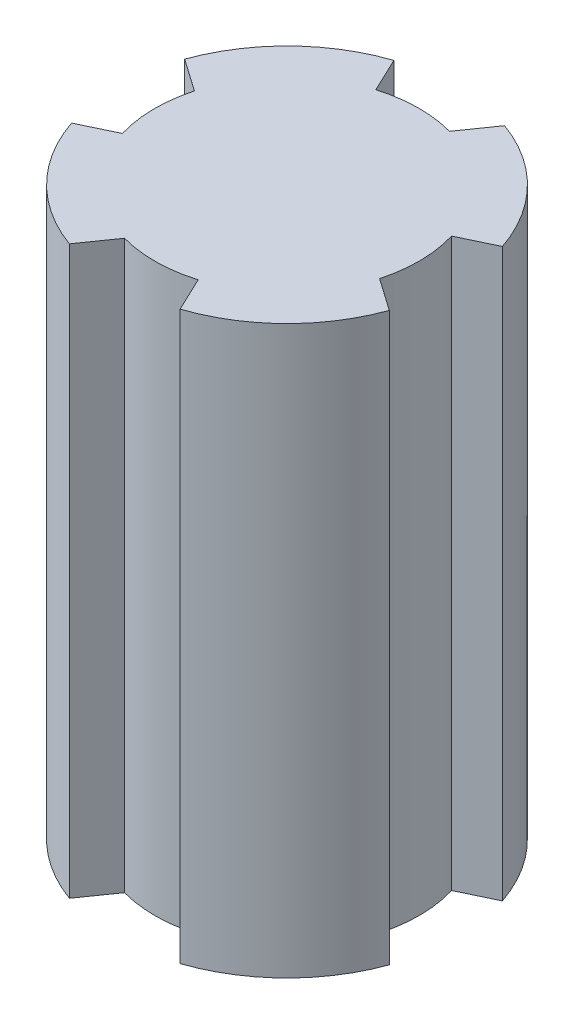
ISO-10303-21;
HEADER;
FILE_DESCRIPTION(('STEP AP214'),'2;1');
FILE_NAME('part.step','',(''),(''),'','','');
FILE_SCHEMA(('AUTOMOTIVE_DESIGN { 1 0 10303 214 1 1 1 1 }'));
ENDSEC;
DATA;
#1=APPLICATION_CONTEXT('core data for automotive mechanical design processes');
#2=APPLICATION_PROTOCOL_DEFINITION('international standard','automotive_design',2000,#1);
#3=PRODUCT_CONTEXT('',#1,'mechanical');
#4=PRODUCT('Part','Part','',(#3));
#5=PRODUCT_RELATED_PRODUCT_CATEGORY('part','',(#4));
#6=PRODUCT_DEFINITION_FORMATION('','',#4);
#7=PRODUCT_DEFINITION_CONTEXT('part definition',#1,'design');
#8=PRODUCT_DEFINITION('design','',#6,#7);
#9=PRODUCT_DEFINITION_SHAPE('','',#8);
#10=(LENGTH_UNIT() NAMED_UNIT(*) SI_UNIT(.MILLI.,.METRE.));
#11=(NAMED_UNIT(*) PLANE_ANGLE_UNIT() SI_UNIT($,.RADIAN.));
#12=(NAMED_UNIT(*) SI_UNIT($,.STERADIAN.) SOLID_ANGLE_UNIT());
#13=UNCERTAINTY_MEASURE_WITH_UNIT(LENGTH_MEASURE(1.E-05),#10,'distance_accuracy_value','');
#14=(GEOMETRIC_REPRESENTATION_CONTEXT(3) GLOBAL_UNCERTAINTY_ASSIGNED_CONTEXT((#13)) GLOBAL_UNIT_ASSIGNED_CONTEXT((#10,
#11,#12)) REPRESENTATION_CONTEXT('',''));
#15=CARTESIAN_POINT('',(0.,0.,0.));
#16=DIRECTION('',(0.,0.,1.));
#17=DIRECTION('',(1.,0.,0.));
#18=AXIS2_PLACEMENT_3D('',#15,#16,#17);
#19=CARTESIAN_POINT('',(0.,15.,0.));
#20=DIRECTION('',(0.,-1.,0.));
#21=DIRECTION('',(0.,0.,-1.));
#22=AXIS2_PLACEMENT_3D('',#19,#20,#21);
#23=CYLINDRICAL_SURFACE('',#22,4.5);
#24=DIRECTION('',(0.,1.,0.));
#25=VECTOR('',#24,1.);
#26=CARTESIAN_POINT('',(-4.26469713166989,0.,1.43609135333607));
#27=LINE('',#26,#25);
#28=CARTESIAN_POINT('',(-4.26469713166989,0.,1.43609135333607));
#29=VERTEX_POINT('',#28);
#30=CARTESIAN_POINT('',(-4.26469713166989,15.,1.43609135333607));
#31=VERTEX_POINT('',#30);
#32=EDGE_CURVE('E202',#29,#31,#27,.T.);
#33=ORIENTED_EDGE('',*,*,#32,.F.);
#34=CARTESIAN_POINT('',(0.,0.,0.));
#35=DIRECTION('',(0.,1.,0.));
#36=DIRECTION('',(0.,0.,1.));
#37=AXIS2_PLACEMENT_3D('',#34,#35,#36);
#38=CIRCLE('',#37,4.5);
#39=CARTESIAN_POINT('',(-1.52547780988289,0.,4.23354667525408));
#40=VERTEX_POINT('',#39);
#41=EDGE_CURVE('E325',#29,#40,#38,.T.);
#42=ORIENTED_EDGE('',*,*,#41,.T.);
#43=DIRECTION('',(0.,1.,0.));
#44=VECTOR('',#43,1.);
#45=CARTESIAN_POINT('',(-1.52547780988289,0.,4.23354667525408));
#46=LINE('',#45,#44);
#47=CARTESIAN_POINT('',(-1.52547780988289,15.,4.23354667525408));
#48=VERTEX_POINT('',#47);
#49=EDGE_CURVE('E65',#40,#48,#46,.T.);
#50=ORIENTED_EDGE('',*,*,#49,.T.);
#51=CARTESIAN_POINT('',(0.,15.,0.));
#52=DIRECTION('',(0.,1.,0.));
#53=DIRECTION('',(0.,0.,1.));
#54=AXIS2_PLACEMENT_3D('',#51,#52,#53);
#55=CIRCLE('',#54,4.5);
#56=EDGE_CURVE('E49',#31,#48,#55,.T.);
#57=ORIENTED_EDGE('',*,*,#56,.F.);
#58=EDGE_LOOP('',(#33,#42,#50,#57));
#59=FACE_BOUND('',#58,.T.);
#60=ADVANCED_FACE('F39',(#59),#23,.T.);
#61=DIRECTION('',(0.,1.,0.));
#62=VECTOR('',#61,1.);
#63=CARTESIAN_POINT('',(1.43609135333605,0.,4.2646971316699));
#64=LINE('',#63,#62);
#65=CARTESIAN_POINT('',(1.43609135333605,0.,4.2646971316699));
#66=VERTEX_POINT('',#65);
#67=CARTESIAN_POINT('',(1.43609135333605,15.,4.2646971316699));
#68=VERTEX_POINT('',#67);
#69=EDGE_CURVE('E232',#66,#68,#64,.T.);
#70=ORIENTED_EDGE('',*,*,#69,.F.);
#71=CARTESIAN_POINT('',(4.2335466752541,0.,1.52547780988285));
#72=VERTEX_POINT('',#71);
#73=EDGE_CURVE('E330',#66,#72,#38,.T.);
#74=ORIENTED_EDGE('',*,*,#73,.T.);
#75=DIRECTION('',(0.,1.,0.));
#76=VECTOR('',#75,1.);
#77=CARTESIAN_POINT('',(4.2335466752541,0.,1.52547780988285));
#78=LINE('',#77,#76);
#79=CARTESIAN_POINT('',(4.2335466752541,15.,1.52547780988285));
#80=VERTEX_POINT('',#79);
#81=EDGE_CURVE('E57',#72,#80,#78,.T.);
#82=ORIENTED_EDGE('',*,*,#81,.T.);
#83=EDGE_CURVE('E321',#68,#80,#55,.T.);
#84=ORIENTED_EDGE('',*,*,#83,.F.);
#85=EDGE_LOOP('',(#70,#74,#82,#84));
#86=FACE_BOUND('',#85,.T.);
#87=ADVANCED_FACE('F338',(#86),#23,.T.);
#88=DIRECTION('',(0.,1.,0.));
#89=VECTOR('',#88,1.);
#90=CARTESIAN_POINT('',(4.26469713166988,0.,-1.43609135333609));
#91=LINE('',#90,#89);
#92=CARTESIAN_POINT('',(4.26469713166988,0.,-1.43609135333609));
#93=VERTEX_POINT('',#92);
#94=CARTESIAN_POINT('',(4.26469713166988,15.,-1.43609135333609));
#95=VERTEX_POINT('',#94);
#96=EDGE_CURVE('E263',#93,#95,#91,.T.);
#97=ORIENTED_EDGE('',*,*,#96,.F.);
#98=CARTESIAN_POINT('',(1.52547780988289,0.,-4.23354667525408));
#99=VERTEX_POINT('',#98);
#100=EDGE_CURVE('E296',#93,#99,#38,.T.);
#101=ORIENTED_EDGE('',*,*,#100,.T.);
#102=DIRECTION('',(0.,1.,0.));
#103=VECTOR('',#102,1.);
#104=CARTESIAN_POINT('',(1.52547780988289,0.,-4.23354667525408));
#105=LINE('',#104,#103);
#106=CARTESIAN_POINT('',(1.52547780988289,15.,-4.23354667525408));
#107=VERTEX_POINT('',#106);
#108=EDGE_CURVE('E300',#99,#107,#105,.T.);
#109=ORIENTED_EDGE('',*,*,#108,.T.);
#110=EDGE_CURVE('E50',#95,#107,#55,.T.);
#111=ORIENTED_EDGE('',*,*,#110,.F.);
#112=EDGE_LOOP('',(#97,#101,#109,#111));
#113=FACE_BOUND('',#112,.T.);
#114=ADVANCED_FACE('F380',(#113),#23,.T.);
#115=CARTESIAN_POINT('',(0.,15.,0.));
#116=DIRECTION('',(0.,1.,0.));
#117=DIRECTION('',(0.,0.,1.));
#118=AXIS2_PLACEMENT_3D('',#115,#116,#117);
#119=PLANE('',#118);
#120=CARTESIAN_POINT('',(0.,15.,0.));
#121=DIRECTION('',(0.,1.,0.));
#122=DIRECTION('',(1.,0.,0.));
#123=AXIS2_PLACEMENT_3D('',#120,#121,#122);
#124=CIRCLE('',#123,3.5);
#125=CARTESIAN_POINT('',(-3.37544595691551,15.,-0.92539969307468));
#126=VERTEX_POINT('',#125);
#127=CARTESIAN_POINT('',(-3.35336574407305,15.,1.00246605253114));
#128=VERTEX_POINT('',#127);
#129=EDGE_CURVE('E164',#126,#128,#124,.T.);
#130=ORIENTED_EDGE('',*,*,#129,.T.);
#131=DIRECTION('',(-0.902992026159099,0.,0.429657306109281));
#132=VECTOR('',#131,1.);
#133=CARTESIAN_POINT('',(-0.230115533495144,15.,-0.483623783156642));
#134=LINE('',#133,#132);
#135=EDGE_CURVE('E184',#128,#31,#134,.T.);
#136=ORIENTED_EDGE('',*,*,#135,.T.);
#137=ORIENTED_EDGE('',*,*,#56,.T.);
#138=DIRECTION('',(-0.573082593814412,0.,0.819497614802475));
#139=VECTOR('',#138,1.);
#140=CARTESIAN_POINT('',(0.963767287761116,15.,0.673971768955969));
#141=LINE('',#140,#139);
#142=CARTESIAN_POINT('',(-0.925399693074692,15.,3.37544595691551));
#143=VERTEX_POINT('',#142);
#144=EDGE_CURVE('E222',#143,#48,#141,.T.);
#145=ORIENTED_EDGE('',*,*,#144,.F.);
#146=CARTESIAN_POINT('',(0.,15.,0.));
#147=DIRECTION('',(0.,1.,0.));
#148=DIRECTION('',(0.,0.,-1.));
#149=AXIS2_PLACEMENT_3D('',#146,#147,#148);
#150=CIRCLE('',#149,3.5);
#151=CARTESIAN_POINT('',(1.00246605253113,15.,3.35336574407306));
#152=VERTEX_POINT('',#151);
#153=EDGE_CURVE('E218',#143,#152,#150,.T.);
#154=ORIENTED_EDGE('',*,*,#153,.T.);
#155=DIRECTION('',(0.429657306109278,0.,0.902992026159101));
#156=VECTOR('',#155,1.);
#157=CARTESIAN_POINT('',(-0.483623783156643,15.,0.230115533495142));
#158=LINE('',#157,#156);
#159=EDGE_CURVE('E211',#152,#68,#158,.T.);
#160=ORIENTED_EDGE('',*,*,#159,.T.);
#161=ORIENTED_EDGE('',*,*,#83,.T.);
#162=DIRECTION('',(0.819497614802481,0.,0.573082593814404));
#163=VECTOR('',#162,1.);
#164=CARTESIAN_POINT('',(0.673971768955959,15.,-0.963767287761123));
#165=LINE('',#164,#163);
#166=CARTESIAN_POINT('',(3.37544595691552,15.,0.925399693074656));
#167=VERTEX_POINT('',#166);
#168=EDGE_CURVE('E254',#167,#80,#165,.T.);
#169=ORIENTED_EDGE('',*,*,#168,.F.);
#170=CARTESIAN_POINT('',(0.,15.,0.));
#171=DIRECTION('',(0.,1.,0.));
#172=DIRECTION('',(-1.,0.,0.));
#173=AXIS2_PLACEMENT_3D('',#170,#171,#172);
#174=CIRCLE('',#173,3.5);
#175=CARTESIAN_POINT('',(3.35336574407305,15.,-1.00246605253116));
#176=VERTEX_POINT('',#175);
#177=EDGE_CURVE('E250',#167,#176,#174,.T.);
#178=ORIENTED_EDGE('',*,*,#177,.T.);
#179=DIRECTION('',(0.902992026159096,0.,-0.429657306109288));
#180=VECTOR('',#179,1.);
#181=CARTESIAN_POINT('',(0.230115533495147,15.,0.48362378315664));
#182=LINE('',#181,#180);
#183=EDGE_CURVE('E243',#176,#95,#182,.T.);
#184=ORIENTED_EDGE('',*,*,#183,.T.);
#185=ORIENTED_EDGE('',*,*,#110,.T.);
#186=DIRECTION('',(0.573082593814412,0.,-0.819497614802475));
#187=VECTOR('',#186,1.);
#188=CARTESIAN_POINT('',(-0.963767287761116,15.,-0.673971768955969));
#189=LINE('',#188,#187);
#190=CARTESIAN_POINT('',(0.925399693074692,15.,-3.37544595691551));
#191=VERTEX_POINT('',#190);
#192=EDGE_CURVE('E285',#191,#107,#189,.T.);
#193=ORIENTED_EDGE('',*,*,#192,.F.);
#194=CARTESIAN_POINT('',(0.,15.,0.));
#195=DIRECTION('',(0.,1.,0.));
#196=DIRECTION('',(0.,0.,1.));
#197=AXIS2_PLACEMENT_3D('',#194,#195,#196);
#198=CIRCLE('',#197,3.5);
#199=CARTESIAN_POINT('',(-1.00246605253113,15.,-3.35336574407306));
#200=VERTEX_POINT('',#199);
#201=EDGE_CURVE('E201',#191,#200,#198,.T.);
#202=ORIENTED_EDGE('',*,*,#201,.T.);
#203=DIRECTION('',(-0.429657306109278,0.,-0.902992026159101));
#204=VECTOR('',#203,1.);
#205=CARTESIAN_POINT('',(0.483623783156643,15.,-0.230115533495142));
#206=LINE('',#205,#204);
#207=CARTESIAN_POINT('',(-1.43609135333605,15.,-4.2646971316699));
#208=VERTEX_POINT('',#207);
#209=EDGE_CURVE('E274',#200,#208,#206,.T.);
#210=ORIENTED_EDGE('',*,*,#209,.T.);
#211=CARTESIAN_POINT('',(-4.23354667525409,15.,-1.52547780988288));
#212=VERTEX_POINT('',#211);
#213=EDGE_CURVE('E11',#208,#212,#55,.T.);
#214=ORIENTED_EDGE('',*,*,#213,.T.);
#215=DIRECTION('',(-0.819497614802477,0.,-0.57308259381441));
#216=VECTOR('',#215,1.);
#217=CARTESIAN_POINT('',(-0.673971768955966,15.,0.963767287761118));
#218=LINE('',#217,#216);
#219=EDGE_CURVE('E188',#126,#212,#218,.T.);
#220=ORIENTED_EDGE('',*,*,#219,.F.);
#221=EDGE_LOOP('',(#130,#136,#137,#145,#154,#160,#161,#169,#178,#184,#185,#193,#202,#210,#214,#220));
#222=FACE_BOUND('',#221,.T.);
#223=ADVANCED_FACE('F316',(#222),#119,.T.);
#224=CARTESIAN_POINT('',(0.,0.,0.));
#225=DIRECTION('',(0.,1.,0.));
#226=DIRECTION('',(0.,0.,1.));
#227=AXIS2_PLACEMENT_3D('',#224,#225,#226);
#228=PLANE('',#227);
#229=DIRECTION('',(-0.902992026159099,0.,0.429657306109281));
#230=VECTOR('',#229,1.);
#231=CARTESIAN_POINT('',(-0.230115533495144,0.,-0.483623783156642));
#232=LINE('',#231,#230);
#233=CARTESIAN_POINT('',(-3.35336574407305,0.,1.00246605253114));
#234=VERTEX_POINT('',#233);
#235=EDGE_CURVE('E169',#234,#29,#232,.T.);
#236=ORIENTED_EDGE('',*,*,#235,.F.);
#237=CARTESIAN_POINT('',(0.,0.,0.));
#238=DIRECTION('',(0.,1.,0.));
#239=DIRECTION('',(1.,0.,0.));
#240=AXIS2_PLACEMENT_3D('',#237,#238,#239);
#241=CIRCLE('',#240,3.5);
#242=CARTESIAN_POINT('',(-3.37544595691551,0.,-0.92539969307468));
#243=VERTEX_POINT('',#242);
#244=EDGE_CURVE('E161',#243,#234,#241,.T.);
#245=ORIENTED_EDGE('',*,*,#244,.F.);
#246=DIRECTION('',(-0.819497614802477,0.,-0.57308259381441));
#247=VECTOR('',#246,1.);
#248=CARTESIAN_POINT('',(-0.673971768955966,0.,0.963767287761118));
#249=LINE('',#248,#247);
#250=CARTESIAN_POINT('',(-4.23354667525409,0.,-1.52547780988288));
#251=VERTEX_POINT('',#250);
#252=EDGE_CURVE('E172',#243,#251,#249,.T.);
#253=ORIENTED_EDGE('',*,*,#252,.T.);
#254=CARTESIAN_POINT('',(-1.43609135333605,0.,-4.2646971316699));
#255=VERTEX_POINT('',#254);
#256=EDGE_CURVE('E43',#255,#251,#38,.T.);
#257=ORIENTED_EDGE('',*,*,#256,.F.);
#258=DIRECTION('',(-0.429657306109278,0.,-0.902992026159101));
#259=VECTOR('',#258,1.);
#260=CARTESIAN_POINT('',(0.483623783156643,0.,-0.230115533495142));
#261=LINE('',#260,#259);
#262=CARTESIAN_POINT('',(-1.00246605253113,0.,-3.35336574407306));
#263=VERTEX_POINT('',#262);
#264=EDGE_CURVE('E278',#263,#255,#261,.T.);
#265=ORIENTED_EDGE('',*,*,#264,.F.);
#266=CARTESIAN_POINT('',(0.,0.,0.));
#267=DIRECTION('',(0.,1.,0.));
#268=DIRECTION('',(0.,0.,1.));
#269=AXIS2_PLACEMENT_3D('',#266,#267,#268);
#270=CIRCLE('',#269,3.5);
#271=CARTESIAN_POINT('',(0.925399693074692,0.,-3.37544595691551));
#272=VERTEX_POINT('',#271);
#273=EDGE_CURVE('E270',#272,#263,#270,.T.);
#274=ORIENTED_EDGE('',*,*,#273,.F.);
#275=DIRECTION('',(0.573082593814412,0.,-0.819497614802475));
#276=VECTOR('',#275,1.);
#277=CARTESIAN_POINT('',(-0.963767287761116,0.,-0.673971768955969));
#278=LINE('',#277,#276);
#279=EDGE_CURVE('E273',#272,#99,#278,.T.);
#280=ORIENTED_EDGE('',*,*,#279,.T.);
#281=ORIENTED_EDGE('',*,*,#100,.F.);
#282=DIRECTION('',(0.902992026159096,0.,-0.429657306109288));
#283=VECTOR('',#282,1.);
#284=CARTESIAN_POINT('',(0.230115533495147,0.,0.48362378315664));
#285=LINE('',#284,#283);
#286=CARTESIAN_POINT('',(3.35336574407305,0.,-1.00246605253116));
#287=VERTEX_POINT('',#286);
#288=EDGE_CURVE('E246',#287,#93,#285,.T.);
#289=ORIENTED_EDGE('',*,*,#288,.F.);
#290=CARTESIAN_POINT('',(0.,0.,0.));
#291=DIRECTION('',(0.,1.,0.));
#292=DIRECTION('',(-1.,0.,0.));
#293=AXIS2_PLACEMENT_3D('',#290,#291,#292);
#294=CIRCLE('',#293,3.5);
#295=CARTESIAN_POINT('',(3.37544595691552,0.,0.925399693074656));
#296=VERTEX_POINT('',#295);
#297=EDGE_CURVE('E239',#296,#287,#294,.T.);
#298=ORIENTED_EDGE('',*,*,#297,.F.);
#299=DIRECTION('',(0.819497614802481,0.,0.573082593814404));
#300=VECTOR('',#299,1.);
#301=CARTESIAN_POINT('',(0.673971768955959,0.,-0.963767287761123));
#302=LINE('',#301,#300);
#303=EDGE_CURVE('E242',#296,#72,#302,.T.);
#304=ORIENTED_EDGE('',*,*,#303,.T.);
#305=ORIENTED_EDGE('',*,*,#73,.F.);
#306=DIRECTION('',(0.429657306109278,0.,0.902992026159101));
#307=VECTOR('',#306,1.);
#308=CARTESIAN_POINT('',(-0.483623783156643,0.,0.230115533495142));
#309=LINE('',#308,#307);
#310=CARTESIAN_POINT('',(1.00246605253113,0.,3.35336574407306));
#311=VERTEX_POINT('',#310);
#312=EDGE_CURVE('E214',#311,#66,#309,.T.);
#313=ORIENTED_EDGE('',*,*,#312,.F.);
#314=CARTESIAN_POINT('',(0.,0.,0.));
#315=DIRECTION('',(0.,1.,0.));
#316=DIRECTION('',(0.,0.,-1.));
#317=AXIS2_PLACEMENT_3D('',#314,#315,#316);
#318=CIRCLE('',#317,3.5);
#319=CARTESIAN_POINT('',(-0.925399693074692,0.,3.37544595691551));
#320=VERTEX_POINT('',#319);
#321=EDGE_CURVE('E207',#320,#311,#318,.T.);
#322=ORIENTED_EDGE('',*,*,#321,.F.);
#323=DIRECTION('',(-0.573082593814412,0.,0.819497614802475));
#324=VECTOR('',#323,1.);
#325=CARTESIAN_POINT('',(0.963767287761116,0.,0.673971768955969));
#326=LINE('',#325,#324);
#327=EDGE_CURVE('E210',#320,#40,#326,.T.);
#328=ORIENTED_EDGE('',*,*,#327,.T.);
#329=ORIENTED_EDGE('',*,*,#41,.F.);
#330=EDGE_LOOP('',(#236,#245,#253,#257,#265,#274,#280,#281,#289,#298,#304,#305,#313,#322,#328,#329));
#331=FACE_BOUND('',#330,.T.);
#332=ADVANCED_FACE('F181',(#331),#228,.F.);
#333=ORIENTED_EDGE('',*,*,#256,.T.);
#334=DIRECTION('',(0.,1.,0.));
#335=VECTOR('',#334,1.);
#336=CARTESIAN_POINT('',(-4.23354667525409,0.,-1.52547780988288));
#337=LINE('',#336,#335);
#338=EDGE_CURVE('E168',#251,#212,#337,.T.);
#339=ORIENTED_EDGE('',*,*,#338,.T.);
#340=ORIENTED_EDGE('',*,*,#213,.F.);
#341=DIRECTION('',(0.,1.,0.));
#342=VECTOR('',#341,1.);
#343=CARTESIAN_POINT('',(-1.43609135333605,0.,-4.2646971316699));
#344=LINE('',#343,#342);
#345=EDGE_CURVE('E297',#255,#208,#344,.T.);
#346=ORIENTED_EDGE('',*,*,#345,.F.);
#347=EDGE_LOOP('',(#333,#339,#340,#346));
#348=FACE_BOUND('',#347,.T.);
#349=ADVANCED_FACE('F41',(#348),#23,.T.);
#350=CARTESIAN_POINT('',(0.,0.,0.));
#351=DIRECTION('',(0.,1.,0.));
#352=DIRECTION('',(0.,0.,1.));
#353=AXIS2_PLACEMENT_3D('',#350,#351,#352);
#354=CYLINDRICAL_SURFACE('',#353,3.5);
#355=ORIENTED_EDGE('',*,*,#201,.F.);
#356=DIRECTION('',(0.,1.,0.));
#357=VECTOR('',#356,1.);
#358=CARTESIAN_POINT('',(0.925399693074692,0.,-3.37544595691551));
#359=LINE('',#358,#357);
#360=EDGE_CURVE('E281',#272,#191,#359,.T.);
#361=ORIENTED_EDGE('',*,*,#360,.F.);
#362=ORIENTED_EDGE('',*,*,#273,.T.);
#363=DIRECTION('',(0.,1.,0.));
#364=VECTOR('',#363,1.);
#365=CARTESIAN_POINT('',(-1.00246605253113,0.,-3.35336574407306));
#366=LINE('',#365,#364);
#367=EDGE_CURVE('E292',#263,#200,#366,.T.);
#368=ORIENTED_EDGE('',*,*,#367,.T.);
#369=EDGE_LOOP('',(#355,#361,#362,#368));
#370=FACE_BOUND('',#369,.T.);
#371=ADVANCED_FACE('F313',(#370),#354,.T.);
#372=CARTESIAN_POINT('',(0.483623783156643,0.,-0.230115533495142));
#373=DIRECTION('',(0.902992026159101,0.,-0.429657306109278));
#374=DIRECTION('',(-0.429657306109278,0.,-0.902992026159101));
#375=AXIS2_PLACEMENT_3D('',#372,#373,#374);
#376=PLANE('',#375);
#377=ORIENTED_EDGE('',*,*,#209,.F.);
#378=ORIENTED_EDGE('',*,*,#367,.F.);
#379=ORIENTED_EDGE('',*,*,#264,.T.);
#380=ORIENTED_EDGE('',*,*,#345,.T.);
#381=EDGE_LOOP('',(#377,#378,#379,#380));
#382=FACE_BOUND('',#381,.T.);
#383=ADVANCED_FACE('F366',(#382),#376,.T.);
#384=CARTESIAN_POINT('',(-0.963767287761116,0.,-0.673971768955969));
#385=DIRECTION('',(0.819497614802475,0.,0.573082593814412));
#386=DIRECTION('',(0.573082593814412,0.,-0.819497614802475));
#387=AXIS2_PLACEMENT_3D('',#384,#385,#386);
#388=PLANE('',#387);
#389=ORIENTED_EDGE('',*,*,#192,.T.);
#390=ORIENTED_EDGE('',*,*,#108,.F.);
#391=ORIENTED_EDGE('',*,*,#279,.F.);
#392=ORIENTED_EDGE('',*,*,#360,.T.);
#393=EDGE_LOOP('',(#389,#390,#391,#392));
#394=FACE_BOUND('',#393,.T.);
#395=ADVANCED_FACE('F308',(#394),#388,.F.);
#396=CARTESIAN_POINT('',(0.,0.,0.));
#397=DIRECTION('',(0.,1.,0.));
#398=DIRECTION('',(0.,0.,1.));
#399=AXIS2_PLACEMENT_3D('',#396,#397,#398);
#400=CYLINDRICAL_SURFACE('',#399,3.5);
#401=ORIENTED_EDGE('',*,*,#177,.F.);
#402=DIRECTION('',(0.,1.,0.));
#403=VECTOR('',#402,1.);
#404=CARTESIAN_POINT('',(3.37544595691552,0.,0.925399693074656));
#405=LINE('',#404,#403);
#406=EDGE_CURVE('E249',#296,#167,#405,.T.);
#407=ORIENTED_EDGE('',*,*,#406,.F.);
#408=ORIENTED_EDGE('',*,*,#297,.T.);
#409=DIRECTION('',(0.,1.,0.));
#410=VECTOR('',#409,1.);
#411=CARTESIAN_POINT('',(3.35336574407305,0.,-1.00246605253116));
#412=LINE('',#411,#410);
#413=EDGE_CURVE('E223',#287,#176,#412,.T.);
#414=ORIENTED_EDGE('',*,*,#413,.T.);
#415=EDGE_LOOP('',(#401,#407,#408,#414));
#416=FACE_BOUND('',#415,.T.);
#417=ADVANCED_FACE('F348',(#416),#400,.T.);
#418=CARTESIAN_POINT('',(0.230115533495147,0.,0.48362378315664));
#419=DIRECTION('',(0.429657306109288,0.,0.902992026159096));
#420=DIRECTION('',(0.902992026159096,0.,-0.429657306109288));
#421=AXIS2_PLACEMENT_3D('',#418,#419,#420);
#422=PLANE('',#421);
#423=ORIENTED_EDGE('',*,*,#183,.F.);
#424=ORIENTED_EDGE('',*,*,#413,.F.);
#425=ORIENTED_EDGE('',*,*,#288,.T.);
#426=ORIENTED_EDGE('',*,*,#96,.T.);
#427=EDGE_LOOP('',(#423,#424,#425,#426));
#428=FACE_BOUND('',#427,.T.);
#429=ADVANCED_FACE('F391',(#428),#422,.T.);
#430=CARTESIAN_POINT('',(0.673971768955959,0.,-0.963767287761123));
#431=DIRECTION('',(-0.573082593814404,0.,0.819497614802481));
#432=DIRECTION('',(0.819497614802481,0.,0.573082593814404));
#433=AXIS2_PLACEMENT_3D('',#430,#431,#432);
#434=PLANE('',#433);
#435=ORIENTED_EDGE('',*,*,#168,.T.);
#436=ORIENTED_EDGE('',*,*,#81,.F.);
#437=ORIENTED_EDGE('',*,*,#303,.F.);
#438=ORIENTED_EDGE('',*,*,#406,.T.);
#439=EDGE_LOOP('',(#435,#436,#437,#438));
#440=FACE_BOUND('',#439,.T.);
#441=ADVANCED_FACE('F344',(#440),#434,.F.);
#442=CARTESIAN_POINT('',(0.,0.,0.));
#443=DIRECTION('',(0.,1.,0.));
#444=DIRECTION('',(0.,0.,1.));
#445=AXIS2_PLACEMENT_3D('',#442,#443,#444);
#446=CYLINDRICAL_SURFACE('',#445,3.5);
#447=ORIENTED_EDGE('',*,*,#153,.F.);
#448=DIRECTION('',(0.,1.,0.));
#449=VECTOR('',#448,1.);
#450=CARTESIAN_POINT('',(-0.925399693074692,0.,3.37544595691551));
#451=LINE('',#450,#449);
#452=EDGE_CURVE('E217',#320,#143,#451,.T.);
#453=ORIENTED_EDGE('',*,*,#452,.F.);
#454=ORIENTED_EDGE('',*,*,#321,.T.);
#455=DIRECTION('',(0.,1.,0.));
#456=VECTOR('',#455,1.);
#457=CARTESIAN_POINT('',(1.00246605253113,0.,3.35336574407306));
#458=LINE('',#457,#456);
#459=EDGE_CURVE('E195',#311,#152,#458,.T.);
#460=ORIENTED_EDGE('',*,*,#459,.T.);
#461=EDGE_LOOP('',(#447,#453,#454,#460));
#462=FACE_BOUND('',#461,.T.);
#463=ADVANCED_FACE('F356',(#462),#446,.T.);
#464=CARTESIAN_POINT('',(-0.483623783156643,0.,0.230115533495142));
#465=DIRECTION('',(-0.902992026159101,0.,0.429657306109278));
#466=DIRECTION('',(0.429657306109278,0.,0.902992026159101));
#467=AXIS2_PLACEMENT_3D('',#464,#465,#466);
#468=PLANE('',#467);
#469=ORIENTED_EDGE('',*,*,#159,.F.);
#470=ORIENTED_EDGE('',*,*,#459,.F.);
#471=ORIENTED_EDGE('',*,*,#312,.T.);
#472=ORIENTED_EDGE('',*,*,#69,.T.);
#473=EDGE_LOOP('',(#469,#470,#471,#472));
#474=FACE_BOUND('',#473,.T.);
#475=ADVANCED_FACE('F354',(#474),#468,.T.);
#476=CARTESIAN_POINT('',(0.963767287761116,0.,0.673971768955969));
#477=DIRECTION('',(-0.819497614802475,0.,-0.573082593814412));
#478=DIRECTION('',(-0.573082593814412,0.,0.819497614802475));
#479=AXIS2_PLACEMENT_3D('',#476,#477,#478);
#480=PLANE('',#479);
#481=ORIENTED_EDGE('',*,*,#144,.T.);
#482=ORIENTED_EDGE('',*,*,#49,.F.);
#483=ORIENTED_EDGE('',*,*,#327,.F.);
#484=ORIENTED_EDGE('',*,*,#452,.T.);
#485=EDGE_LOOP('',(#481,#482,#483,#484));
#486=FACE_BOUND('',#485,.T.);
#487=ADVANCED_FACE('F402',(#486),#480,.F.);
#488=CARTESIAN_POINT('',(0.,0.,0.));
#489=DIRECTION('',(0.,1.,0.));
#490=DIRECTION('',(0.,0.,1.));
#491=AXIS2_PLACEMENT_3D('',#488,#489,#490);
#492=CYLINDRICAL_SURFACE('',#491,3.5);
#493=ORIENTED_EDGE('',*,*,#129,.F.);
#494=DIRECTION('',(0.,1.,0.));
#495=VECTOR('',#494,1.);
#496=CARTESIAN_POINT('',(-3.37544595691551,0.,-0.92539969307468));
#497=LINE('',#496,#495);
#498=EDGE_CURVE('E156',#243,#126,#497,.T.);
#499=ORIENTED_EDGE('',*,*,#498,.F.);
#500=ORIENTED_EDGE('',*,*,#244,.T.);
#501=DIRECTION('',(0.,1.,0.));
#502=VECTOR('',#501,1.);
#503=CARTESIAN_POINT('',(-3.35336574407305,0.,1.00246605253114));
#504=LINE('',#503,#502);
#505=EDGE_CURVE('E198',#234,#128,#504,.T.);
#506=ORIENTED_EDGE('',*,*,#505,.T.);
#507=EDGE_LOOP('',(#493,#499,#500,#506));
#508=FACE_BOUND('',#507,.T.);
#509=ADVANCED_FACE('F158',(#508),#492,.T.);
#510=CARTESIAN_POINT('',(-0.230115533495144,0.,-0.483623783156642));
#511=DIRECTION('',(-0.429657306109281,0.,-0.902992026159099));
#512=DIRECTION('',(-0.902992026159099,0.,0.429657306109282));
#513=AXIS2_PLACEMENT_3D('',#510,#511,#512);
#514=PLANE('',#513);
#515=ORIENTED_EDGE('',*,*,#135,.F.);
#516=ORIENTED_EDGE('',*,*,#505,.F.);
#517=ORIENTED_EDGE('',*,*,#235,.T.);
#518=ORIENTED_EDGE('',*,*,#32,.T.);
#519=EDGE_LOOP('',(#515,#516,#517,#518));
#520=FACE_BOUND('',#519,.T.);
#521=ADVANCED_FACE('F362',(#520),#514,.T.);
#522=CARTESIAN_POINT('',(-0.673971768955966,0.,0.963767287761118));
#523=DIRECTION('',(0.57308259381441,0.,-0.819497614802477));
#524=DIRECTION('',(-0.819497614802477,0.,-0.57308259381441));
#525=AXIS2_PLACEMENT_3D('',#522,#523,#524);
#526=PLANE('',#525);
#527=ORIENTED_EDGE('',*,*,#219,.T.);
#528=ORIENTED_EDGE('',*,*,#338,.F.);
#529=ORIENTED_EDGE('',*,*,#252,.F.);
#530=ORIENTED_EDGE('',*,*,#498,.T.);
#531=EDGE_LOOP('',(#527,#528,#529,#530));
#532=FACE_BOUND('',#531,.T.);
#533=ADVANCED_FACE('F173',(#532),#526,.F.);
#534=CLOSED_SHELL('',(#60,#87,#114,#223,#332,#349,#371,#383,#395,#417,#429,#441,#463,#475,#487,
#509,#521,#533));
#535=MANIFOLD_SOLID_BREP('B2',#534);
#536=ADVANCED_BREP_SHAPE_REPRESENTATION('',(#18,#535),#14);
#537=SHAPE_DEFINITION_REPRESENTATION(#9,#536);
ENDSEC;
END-ISO-10303-21;
